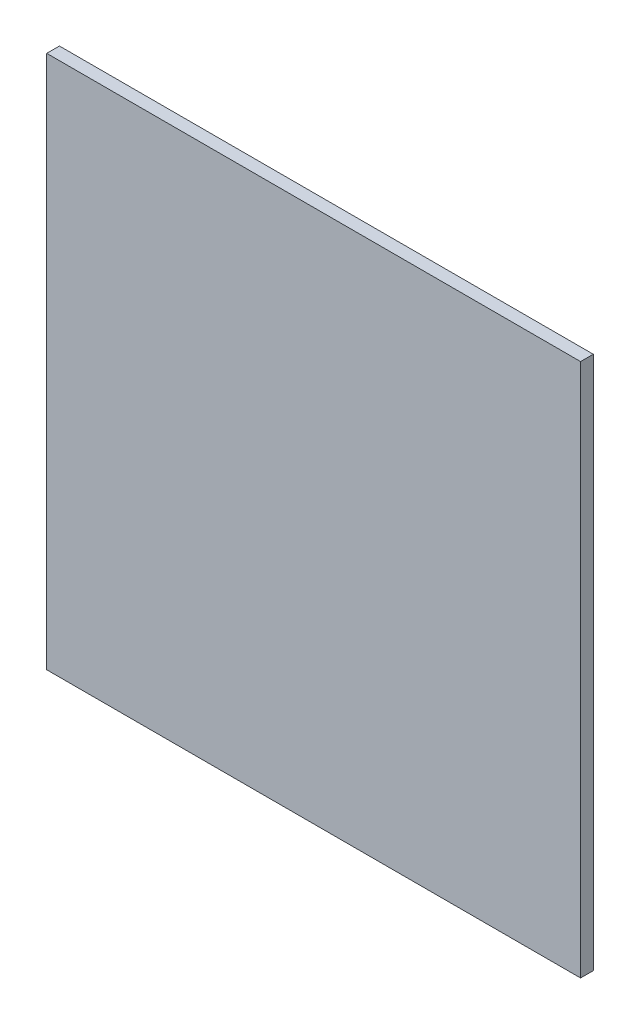
ISO-10303-21;
HEADER;
FILE_DESCRIPTION(('STEP AP214'),'2;1');
FILE_NAME('part.step','',(''),(''),'','','');
FILE_SCHEMA(('AUTOMOTIVE_DESIGN { 1 0 10303 214 1 1 1 1 }'));
ENDSEC;
DATA;
#1=APPLICATION_CONTEXT('core data for automotive mechanical design processes');
#2=APPLICATION_PROTOCOL_DEFINITION('international standard','automotive_design',2000,#1);
#3=PRODUCT_CONTEXT('',#1,'mechanical');
#4=PRODUCT('Part','Part','',(#3));
#5=PRODUCT_RELATED_PRODUCT_CATEGORY('part','',(#4));
#6=PRODUCT_DEFINITION_FORMATION('','',#4);
#7=PRODUCT_DEFINITION_CONTEXT('part definition',#1,'design');
#8=PRODUCT_DEFINITION('design','',#6,#7);
#9=PRODUCT_DEFINITION_SHAPE('','',#8);
#10=(LENGTH_UNIT() NAMED_UNIT(*) SI_UNIT(.MILLI.,.METRE.));
#11=(NAMED_UNIT(*) PLANE_ANGLE_UNIT() SI_UNIT($,.RADIAN.));
#12=(NAMED_UNIT(*) SI_UNIT($,.STERADIAN.) SOLID_ANGLE_UNIT());
#13=UNCERTAINTY_MEASURE_WITH_UNIT(LENGTH_MEASURE(1.E-05),#10,'distance_accuracy_value','');
#14=(GEOMETRIC_REPRESENTATION_CONTEXT(3) GLOBAL_UNCERTAINTY_ASSIGNED_CONTEXT((#13)) GLOBAL_UNIT_ASSIGNED_CONTEXT((#10,
#11,#12)) REPRESENTATION_CONTEXT('',''));
#15=CARTESIAN_POINT('',(0.,0.,0.));
#16=DIRECTION('',(0.,0.,1.));
#17=DIRECTION('',(1.,0.,0.));
#18=AXIS2_PLACEMENT_3D('',#15,#16,#17);
#19=CARTESIAN_POINT('',(0.,0.,2.54));
#20=DIRECTION('',(-1.,0.,0.));
#21=DIRECTION('',(0.,0.,1.));
#22=AXIS2_PLACEMENT_3D('',#19,#20,#21);
#23=PLANE('',#22);
#24=DIRECTION('',(0.,1.,0.));
#25=VECTOR('',#24,1.);
#26=CARTESIAN_POINT('',(0.,0.,0.));
#27=LINE('',#26,#25);
#28=CARTESIAN_POINT('',(0.,0.,0.));
#29=VERTEX_POINT('',#28);
#30=CARTESIAN_POINT('',(0.,106.68,0.));
#31=VERTEX_POINT('',#30);
#32=EDGE_CURVE('E95',#29,#31,#27,.T.);
#33=ORIENTED_EDGE('',*,*,#32,.T.);
#34=DIRECTION('',(0.,0.,-1.));
#35=VECTOR('',#34,1.);
#36=CARTESIAN_POINT('',(0.,106.68,2.54));
#37=LINE('',#36,#35);
#38=CARTESIAN_POINT('',(0.,106.68,2.54));
#39=VERTEX_POINT('',#38);
#40=EDGE_CURVE('E11',#39,#31,#37,.T.);
#41=ORIENTED_EDGE('',*,*,#40,.F.);
#42=DIRECTION('',(0.,1.,0.));
#43=VECTOR('',#42,1.);
#44=CARTESIAN_POINT('',(0.,0.,2.54));
#45=LINE('',#44,#43);
#46=CARTESIAN_POINT('',(0.,0.,2.54));
#47=VERTEX_POINT('',#46);
#48=EDGE_CURVE('E83',#47,#39,#45,.T.);
#49=ORIENTED_EDGE('',*,*,#48,.F.);
#50=DIRECTION('',(0.,0.,-1.));
#51=VECTOR('',#50,1.);
#52=CARTESIAN_POINT('',(0.,0.,2.54));
#53=LINE('',#52,#51);
#54=EDGE_CURVE('E91',#47,#29,#53,.T.);
#55=ORIENTED_EDGE('',*,*,#54,.T.);
#56=EDGE_LOOP('',(#33,#41,#49,#55));
#57=FACE_BOUND('',#56,.T.);
#58=ADVANCED_FACE('F32',(#57),#23,.F.);
#59=CARTESIAN_POINT('',(0.,106.68,2.54));
#60=DIRECTION('',(0.,-1.,0.));
#61=DIRECTION('',(1.,0.,0.));
#62=AXIS2_PLACEMENT_3D('',#59,#60,#61);
#63=PLANE('',#62);
#64=DIRECTION('',(-1.,0.,0.));
#65=VECTOR('',#64,1.);
#66=CARTESIAN_POINT('',(0.,106.68,0.));
#67=LINE('',#66,#65);
#68=CARTESIAN_POINT('',(-106.68,106.68,0.));
#69=VERTEX_POINT('',#68);
#70=EDGE_CURVE('E87',#31,#69,#67,.T.);
#71=ORIENTED_EDGE('',*,*,#70,.T.);
#72=DIRECTION('',(0.,0.,-1.));
#73=VECTOR('',#72,1.);
#74=CARTESIAN_POINT('',(-106.68,106.68,2.54));
#75=LINE('',#74,#73);
#76=CARTESIAN_POINT('',(-106.68,106.68,2.54));
#77=VERTEX_POINT('',#76);
#78=EDGE_CURVE('E40',#77,#69,#75,.T.);
#79=ORIENTED_EDGE('',*,*,#78,.F.);
#80=DIRECTION('',(-1.,0.,0.));
#81=VECTOR('',#80,1.);
#82=CARTESIAN_POINT('',(0.,106.68,2.54));
#83=LINE('',#82,#81);
#84=EDGE_CURVE('E78',#39,#77,#83,.T.);
#85=ORIENTED_EDGE('',*,*,#84,.F.);
#86=ORIENTED_EDGE('',*,*,#40,.T.);
#87=EDGE_LOOP('',(#71,#79,#85,#86));
#88=FACE_BOUND('',#87,.T.);
#89=ADVANCED_FACE('F86',(#88),#63,.F.);
#90=CARTESIAN_POINT('',(-106.68,0.,2.54));
#91=DIRECTION('',(1.,0.,0.));
#92=DIRECTION('',(0.,1.,0.));
#93=AXIS2_PLACEMENT_3D('',#90,#91,#92);
#94=PLANE('',#93);
#95=DIRECTION('',(0.,-1.,0.));
#96=VECTOR('',#95,1.);
#97=CARTESIAN_POINT('',(-106.68,0.,0.));
#98=LINE('',#97,#96);
#99=CARTESIAN_POINT('',(-106.68,0.,0.));
#100=VERTEX_POINT('',#99);
#101=EDGE_CURVE('E65',#69,#100,#98,.T.);
#102=ORIENTED_EDGE('',*,*,#101,.T.);
#103=DIRECTION('',(0.,0.,-1.));
#104=VECTOR('',#103,1.);
#105=CARTESIAN_POINT('',(-106.68,0.,2.54));
#106=LINE('',#105,#104);
#107=CARTESIAN_POINT('',(-106.68,0.,2.54));
#108=VERTEX_POINT('',#107);
#109=EDGE_CURVE('E88',#108,#100,#106,.T.);
#110=ORIENTED_EDGE('',*,*,#109,.F.);
#111=DIRECTION('',(0.,-1.,0.));
#112=VECTOR('',#111,1.);
#113=CARTESIAN_POINT('',(-106.68,0.,2.54));
#114=LINE('',#113,#112);
#115=EDGE_CURVE('E81',#77,#108,#114,.T.);
#116=ORIENTED_EDGE('',*,*,#115,.F.);
#117=ORIENTED_EDGE('',*,*,#78,.T.);
#118=EDGE_LOOP('',(#102,#110,#116,#117));
#119=FACE_BOUND('',#118,.T.);
#120=ADVANCED_FACE('F89',(#119),#94,.F.);
#121=CARTESIAN_POINT('',(0.,0.,2.54));
#122=DIRECTION('',(0.,1.,0.));
#123=DIRECTION('',(-1.,0.,0.));
#124=AXIS2_PLACEMENT_3D('',#121,#122,#123);
#125=PLANE('',#124);
#126=DIRECTION('',(1.,0.,0.));
#127=VECTOR('',#126,1.);
#128=CARTESIAN_POINT('',(0.,0.,0.));
#129=LINE('',#128,#127);
#130=EDGE_CURVE('E71',#100,#29,#129,.T.);
#131=ORIENTED_EDGE('',*,*,#130,.T.);
#132=ORIENTED_EDGE('',*,*,#54,.F.);
#133=DIRECTION('',(1.,0.,0.));
#134=VECTOR('',#133,1.);
#135=CARTESIAN_POINT('',(0.,0.,2.54));
#136=LINE('',#135,#134);
#137=EDGE_CURVE('E48',#108,#47,#136,.T.);
#138=ORIENTED_EDGE('',*,*,#137,.F.);
#139=ORIENTED_EDGE('',*,*,#109,.T.);
#140=EDGE_LOOP('',(#131,#132,#138,#139));
#141=FACE_BOUND('',#140,.T.);
#142=ADVANCED_FACE('F102',(#141),#125,.F.);
#143=CARTESIAN_POINT('',(0.,106.68,2.54));
#144=DIRECTION('',(0.,0.,1.));
#145=DIRECTION('',(1.,0.,0.));
#146=AXIS2_PLACEMENT_3D('',#143,#144,#145);
#147=PLANE('',#146);
#148=ORIENTED_EDGE('',*,*,#48,.T.);
#149=ORIENTED_EDGE('',*,*,#84,.T.);
#150=ORIENTED_EDGE('',*,*,#115,.T.);
#151=ORIENTED_EDGE('',*,*,#137,.T.);
#152=EDGE_LOOP('',(#148,#149,#150,#151));
#153=FACE_BOUND('',#152,.T.);
#154=ADVANCED_FACE('F79',(#153),#147,.T.);
#155=CARTESIAN_POINT('',(0.,106.68,0.));
#156=DIRECTION('',(0.,0.,1.));
#157=DIRECTION('',(1.,0.,0.));
#158=AXIS2_PLACEMENT_3D('',#155,#156,#157);
#159=PLANE('',#158);
#160=ORIENTED_EDGE('',*,*,#32,.F.);
#161=ORIENTED_EDGE('',*,*,#130,.F.);
#162=ORIENTED_EDGE('',*,*,#101,.F.);
#163=ORIENTED_EDGE('',*,*,#70,.F.);
#164=EDGE_LOOP('',(#160,#161,#162,#163));
#165=FACE_BOUND('',#164,.T.);
#166=ADVANCED_FACE('F105',(#165),#159,.F.);
#167=CLOSED_SHELL('',(#58,#89,#120,#142,#154,#166));
#168=MANIFOLD_SOLID_BREP('B2',#167);
#169=ADVANCED_BREP_SHAPE_REPRESENTATION('',(#18,#168),#14);
#170=SHAPE_DEFINITION_REPRESENTATION(#9,#169);
ENDSEC;
END-ISO-10303-21;
